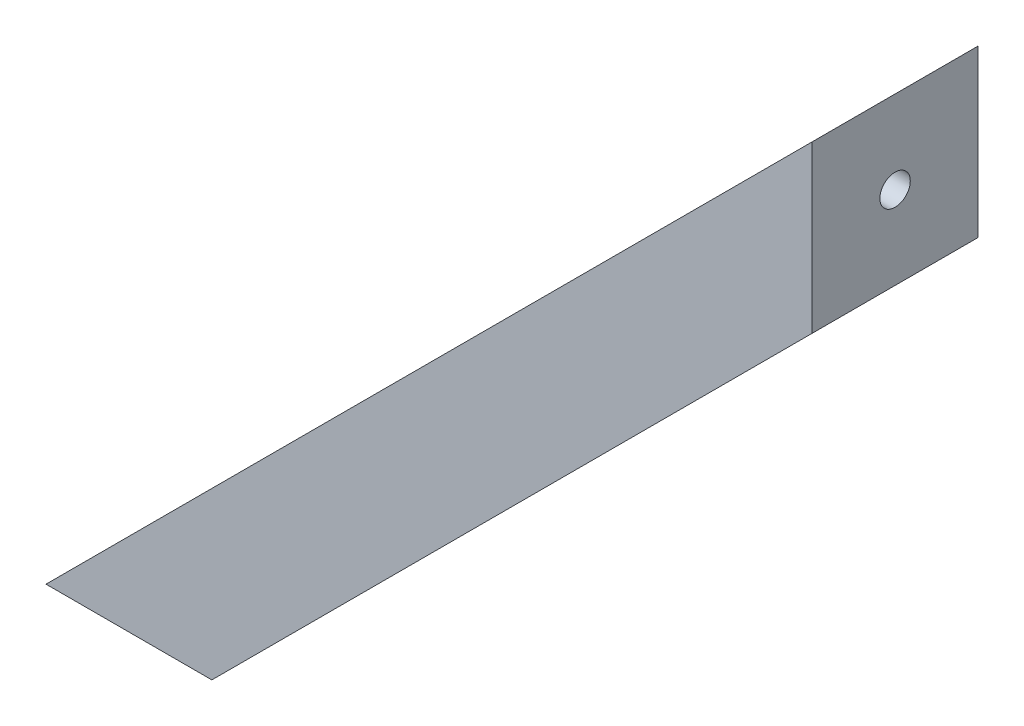
ISO-10303-21;
HEADER;
FILE_DESCRIPTION(('STEP AP214'),'2;1');
FILE_NAME('part.step','',(''),(''),'','','');
FILE_SCHEMA(('AUTOMOTIVE_DESIGN { 1 0 10303 214 1 1 1 1 }'));
ENDSEC;
DATA;
#1=APPLICATION_CONTEXT('core data for automotive mechanical design processes');
#2=APPLICATION_PROTOCOL_DEFINITION('international standard','automotive_design',2000,#1);
#3=PRODUCT_CONTEXT('',#1,'mechanical');
#4=PRODUCT('Part','Part','',(#3));
#5=PRODUCT_RELATED_PRODUCT_CATEGORY('part','',(#4));
#6=PRODUCT_DEFINITION_FORMATION('','',#4);
#7=PRODUCT_DEFINITION_CONTEXT('part definition',#1,'design');
#8=PRODUCT_DEFINITION('design','',#6,#7);
#9=PRODUCT_DEFINITION_SHAPE('','',#8);
#10=(LENGTH_UNIT() NAMED_UNIT(*) SI_UNIT(.MILLI.,.METRE.));
#11=(NAMED_UNIT(*) PLANE_ANGLE_UNIT() SI_UNIT($,.RADIAN.));
#12=(NAMED_UNIT(*) SI_UNIT($,.STERADIAN.) SOLID_ANGLE_UNIT());
#13=UNCERTAINTY_MEASURE_WITH_UNIT(LENGTH_MEASURE(1.E-05),#10,'distance_accuracy_value','');
#14=(GEOMETRIC_REPRESENTATION_CONTEXT(3) GLOBAL_UNCERTAINTY_ASSIGNED_CONTEXT((#13)) GLOBAL_UNIT_ASSIGNED_CONTEXT((#10,
#11,#12)) REPRESENTATION_CONTEXT('',''));
#15=CARTESIAN_POINT('',(0.,0.,0.));
#16=DIRECTION('',(0.,0.,1.));
#17=DIRECTION('',(1.,0.,0.));
#18=AXIS2_PLACEMENT_3D('',#15,#16,#17);
#19=CARTESIAN_POINT('',(171.52289191242,142.403148033491,38.1));
#20=DIRECTION('',(-0.707106781186546,0.707106781186549,0.));
#21=DIRECTION('',(-0.707106781186549,-0.707106781186546,0.));
#22=AXIS2_PLACEMENT_3D('',#19,#20,#21);
#23=PLANE('',#22);
#24=DIRECTION('',(0.,0.,1.));
#25=VECTOR('',#24,1.);
#26=CARTESIAN_POINT('',(68.800618910722,39.6808750317935,6.35));
#27=LINE('',#26,#25);
#28=CARTESIAN_POINT('',(68.800618910722,39.6808750317935,6.35));
#29=VERTEX_POINT('',#28);
#30=CARTESIAN_POINT('',(68.800618910722,39.6808750317935,31.75));
#31=VERTEX_POINT('',#30);
#32=EDGE_CURVE('E59',#29,#31,#27,.T.);
#33=ORIENTED_EDGE('',*,*,#32,.T.);
#34=DIRECTION('',(0.707106781186549,0.707106781186546,0.));
#35=VECTOR('',#34,1.);
#36=CARTESIAN_POINT('',(171.52289191242,142.403148033491,31.75));
#37=LINE('',#36,#35);
#38=CARTESIAN_POINT('',(100.231515334464,71.1117714555355,31.75));
#39=VERTEX_POINT('',#38);
#40=EDGE_CURVE('E290',#31,#39,#37,.T.);
#41=ORIENTED_EDGE('',*,*,#40,.T.);
#42=DIRECTION('',(0.,0.,-1.));
#43=VECTOR('',#42,1.);
#44=CARTESIAN_POINT('',(100.231515334464,71.1117714555355,6.35));
#45=LINE('',#44,#43);
#46=CARTESIAN_POINT('',(100.231515334464,71.1117714555355,6.35));
#47=VERTEX_POINT('',#46);
#48=EDGE_CURVE('E240',#39,#47,#45,.T.);
#49=ORIENTED_EDGE('',*,*,#48,.T.);
#50=DIRECTION('',(0.707106781186549,0.707106781186546,0.));
#51=VECTOR('',#50,1.);
#52=CARTESIAN_POINT('',(171.52289191242,142.403148033491,6.35));
#53=LINE('',#52,#51);
#54=EDGE_CURVE('E282',#29,#47,#53,.T.);
#55=ORIENTED_EDGE('',*,*,#54,.F.);
#56=EDGE_LOOP('',(#33,#41,#49,#55));
#57=FACE_BOUND('',#56,.T.);
#58=ADVANCED_FACE('F43',(#57),#23,.T.);
#59=CARTESIAN_POINT('',(0.,0.,31.75));
#60=DIRECTION('',(0.,0.,1.));
#61=DIRECTION('',(1.,0.,0.));
#62=AXIS2_PLACEMENT_3D('',#59,#60,#61);
#63=PLANE('',#62);
#64=ORIENTED_EDGE('',*,*,#40,.F.);
#65=DIRECTION('',(-0.707106781186551,0.707106781186544,0.));
#66=VECTOR('',#65,1.);
#67=CARTESIAN_POINT('',(87.3138911768564,21.1676027656593,31.75));
#68=LINE('',#67,#66);
#69=CARTESIAN_POINT('',(54.2407469712574,54.240746971258,31.75));
#70=VERTEX_POINT('',#69);
#71=EDGE_CURVE('E436',#31,#70,#68,.T.);
#72=ORIENTED_EDGE('',*,*,#71,.T.);
#73=DIRECTION('',(-0.707106781186544,-0.707106781186552,0.));
#74=VECTOR('',#73,1.);
#75=CARTESIAN_POINT('',(0.,0.,31.75));
#76=LINE('',#75,#74);
#77=CARTESIAN_POINT('',(85.6716433949993,85.6716433950002,31.75));
#78=VERTEX_POINT('',#77);
#79=EDGE_CURVE('E301',#78,#70,#76,.T.);
#80=ORIENTED_EDGE('',*,*,#79,.F.);
#81=DIRECTION('',(-0.707106781186551,0.707106781186544,0.));
#82=VECTOR('',#81,1.);
#83=CARTESIAN_POINT('',(118.744787600598,52.5984991894015,31.75));
#84=LINE('',#83,#82);
#85=EDGE_CURVE('E253',#39,#78,#84,.T.);
#86=ORIENTED_EDGE('',*,*,#85,.F.);
#87=EDGE_LOOP('',(#64,#72,#80,#86));
#88=FACE_BOUND('',#87,.T.);
#89=ADVANCED_FACE('F359',(#88),#63,.F.);
#90=CARTESIAN_POINT('',(0.,0.,6.35));
#91=DIRECTION('',(0.,0.,1.));
#92=DIRECTION('',(1.,0.,0.));
#93=AXIS2_PLACEMENT_3D('',#90,#91,#92);
#94=PLANE('',#93);
#95=DIRECTION('',(-0.707106781186551,0.707106781186544,0.));
#96=VECTOR('',#95,1.);
#97=CARTESIAN_POINT('',(87.3138911768564,21.1676027656593,6.35));
#98=LINE('',#97,#96);
#99=CARTESIAN_POINT('',(54.2407469712574,54.240746971258,6.35));
#100=VERTEX_POINT('',#99);
#101=EDGE_CURVE('E216',#29,#100,#98,.T.);
#102=ORIENTED_EDGE('',*,*,#101,.F.);
#103=ORIENTED_EDGE('',*,*,#54,.T.);
#104=DIRECTION('',(-0.707106781186551,0.707106781186544,0.));
#105=VECTOR('',#104,1.);
#106=CARTESIAN_POINT('',(118.744787600598,52.5984991894015,6.35));
#107=LINE('',#106,#105);
#108=CARTESIAN_POINT('',(85.6716433949993,85.6716433950002,6.35));
#109=VERTEX_POINT('',#108);
#110=EDGE_CURVE('E247',#47,#109,#107,.T.);
#111=ORIENTED_EDGE('',*,*,#110,.T.);
#112=DIRECTION('',(-0.707106781186544,-0.707106781186552,0.));
#113=VECTOR('',#112,1.);
#114=CARTESIAN_POINT('',(0.,0.,6.35));
#115=LINE('',#114,#113);
#116=EDGE_CURVE('E192',#109,#100,#115,.T.);
#117=ORIENTED_EDGE('',*,*,#116,.T.);
#118=EDGE_LOOP('',(#102,#103,#111,#117));
#119=FACE_BOUND('',#118,.T.);
#120=ADVANCED_FACE('F367',(#119),#94,.T.);
#121=DIRECTION('',(0.,0.,1.));
#122=VECTOR('',#121,1.);
#123=CARTESIAN_POINT('',(140.642667879275,111.522924000347,6.35));
#124=LINE('',#123,#122);
#125=CARTESIAN_POINT('',(140.642667879275,111.522924000347,6.35));
#126=VERTEX_POINT('',#125);
#127=CARTESIAN_POINT('',(140.642667879275,111.522924000347,31.75));
#128=VERTEX_POINT('',#127);
#129=EDGE_CURVE('E210',#126,#128,#124,.T.);
#130=ORIENTED_EDGE('',*,*,#129,.T.);
#131=CARTESIAN_POINT('',(169.663019972954,140.543276094026,31.75));
#132=VERTEX_POINT('',#131);
#133=EDGE_CURVE('E280',#128,#132,#37,.T.);
#134=ORIENTED_EDGE('',*,*,#133,.T.);
#135=DIRECTION('',(0.,0.,-1.));
#136=VECTOR('',#135,1.);
#137=CARTESIAN_POINT('',(169.663019972954,140.543276094026,38.1));
#138=LINE('',#137,#136);
#139=CARTESIAN_POINT('',(169.663019972954,140.543276094026,6.35));
#140=VERTEX_POINT('',#139);
#141=EDGE_CURVE('E276',#132,#140,#138,.T.);
#142=ORIENTED_EDGE('',*,*,#141,.T.);
#143=EDGE_CURVE('E271',#126,#140,#53,.T.);
#144=ORIENTED_EDGE('',*,*,#143,.F.);
#145=EDGE_LOOP('',(#130,#134,#142,#144));
#146=FACE_BOUND('',#145,.T.);
#147=ADVANCED_FACE('F361',(#146),#23,.T.);
#148=ORIENTED_EDGE('',*,*,#133,.F.);
#149=DIRECTION('',(-0.707106781186551,0.707106781186544,0.));
#150=VECTOR('',#149,1.);
#151=CARTESIAN_POINT('',(159.155940145409,93.0096517342129,31.75));
#152=LINE('',#151,#150);
#153=CARTESIAN_POINT('',(126.08279593981,126.082795939812,31.75));
#154=VERTEX_POINT('',#153);
#155=EDGE_CURVE('E226',#128,#154,#152,.T.);
#156=ORIENTED_EDGE('',*,*,#155,.T.);
#157=CARTESIAN_POINT('',(169.663019972954,169.663019972956,31.75));
#158=VERTEX_POINT('',#157);
#159=EDGE_CURVE('E297',#158,#154,#76,.T.);
#160=ORIENTED_EDGE('',*,*,#159,.F.);
#161=DIRECTION('',(0.,1.,0.));
#162=VECTOR('',#161,1.);
#163=CARTESIAN_POINT('',(169.663019972954,176.013019972956,31.75));
#164=LINE('',#163,#162);
#165=EDGE_CURVE('E289',#132,#158,#164,.T.);
#166=ORIENTED_EDGE('',*,*,#165,.F.);
#167=EDGE_LOOP('',(#148,#156,#160,#166));
#168=FACE_BOUND('',#167,.T.);
#169=ADVANCED_FACE('F370',(#168),#63,.F.);
#170=DIRECTION('',(-0.707106781186551,0.707106781186544,0.));
#171=VECTOR('',#170,1.);
#172=CARTESIAN_POINT('',(159.155940145409,93.0096517342129,6.35));
#173=LINE('',#172,#171);
#174=CARTESIAN_POINT('',(126.08279593981,126.082795939812,6.35));
#175=VERTEX_POINT('',#174);
#176=EDGE_CURVE('E229',#126,#175,#173,.T.);
#177=ORIENTED_EDGE('',*,*,#176,.F.);
#178=ORIENTED_EDGE('',*,*,#143,.T.);
#179=DIRECTION('',(0.,1.,0.));
#180=VECTOR('',#179,1.);
#181=CARTESIAN_POINT('',(169.663019972954,176.013019972956,6.35));
#182=LINE('',#181,#180);
#183=CARTESIAN_POINT('',(169.663019972954,169.663019972956,6.35));
#184=VERTEX_POINT('',#183);
#185=EDGE_CURVE('E193',#140,#184,#182,.T.);
#186=ORIENTED_EDGE('',*,*,#185,.T.);
#187=EDGE_CURVE('E196',#184,#175,#115,.T.);
#188=ORIENTED_EDGE('',*,*,#187,.T.);
#189=EDGE_LOOP('',(#177,#178,#186,#188));
#190=FACE_BOUND('',#189,.T.);
#191=ADVANCED_FACE('F391',(#190),#94,.T.);
#192=DIRECTION('',(0.,0.,-1.));
#193=VECTOR('',#192,1.);
#194=CARTESIAN_POINT('',(136.152539818741,107.032795939812,6.35));
#195=LINE('',#194,#193);
#196=CARTESIAN_POINT('',(136.152539818741,107.032795939812,31.75));
#197=VERTEX_POINT('',#196);
#198=CARTESIAN_POINT('',(136.152539818741,107.032795939812,6.35));
#199=VERTEX_POINT('',#198);
#200=EDGE_CURVE('E207',#197,#199,#195,.T.);
#201=ORIENTED_EDGE('',*,*,#200,.T.);
#202=CARTESIAN_POINT('',(104.721643394999,75.60189951607,6.35));
#203=VERTEX_POINT('',#202);
#204=EDGE_CURVE('E283',#203,#199,#53,.T.);
#205=ORIENTED_EDGE('',*,*,#204,.F.);
#206=DIRECTION('',(0.,0.,1.));
#207=VECTOR('',#206,1.);
#208=CARTESIAN_POINT('',(104.721643394999,75.60189951607,6.35));
#209=LINE('',#208,#207);
#210=CARTESIAN_POINT('',(104.721643394999,75.60189951607,31.75));
#211=VERTEX_POINT('',#210);
#212=EDGE_CURVE('E238',#203,#211,#209,.T.);
#213=ORIENTED_EDGE('',*,*,#212,.T.);
#214=EDGE_CURVE('E291',#211,#197,#37,.T.);
#215=ORIENTED_EDGE('',*,*,#214,.T.);
#216=EDGE_LOOP('',(#201,#205,#213,#215));
#217=FACE_BOUND('',#216,.T.);
#218=ADVANCED_FACE('F376',(#217),#23,.T.);
#219=CARTESIAN_POINT('',(121.592667879276,121.592667879277,31.75));
#220=VERTEX_POINT('',#219);
#221=CARTESIAN_POINT('',(90.1617714555338,90.1617714555348,31.75));
#222=VERTEX_POINT('',#221);
#223=EDGE_CURVE('E300',#220,#222,#76,.T.);
#224=ORIENTED_EDGE('',*,*,#223,.F.);
#225=DIRECTION('',(-0.707106781186551,0.707106781186544,0.));
#226=VECTOR('',#225,1.);
#227=CARTESIAN_POINT('',(154.665812084875,88.5195236736783,31.75));
#228=LINE('',#227,#226);
#229=EDGE_CURVE('E223',#197,#220,#228,.T.);
#230=ORIENTED_EDGE('',*,*,#229,.F.);
#231=ORIENTED_EDGE('',*,*,#214,.F.);
#232=DIRECTION('',(-0.707106781186551,0.707106781186544,0.));
#233=VECTOR('',#232,1.);
#234=CARTESIAN_POINT('',(123.234915661133,57.0886272499361,31.75));
#235=LINE('',#234,#233);
#236=EDGE_CURVE('E250',#211,#222,#235,.T.);
#237=ORIENTED_EDGE('',*,*,#236,.T.);
#238=EDGE_LOOP('',(#224,#230,#231,#237));
#239=FACE_BOUND('',#238,.T.);
#240=ADVANCED_FACE('F390',(#239),#63,.F.);
#241=DIRECTION('',(-0.707106781186551,0.707106781186544,0.));
#242=VECTOR('',#241,1.);
#243=CARTESIAN_POINT('',(154.665812084875,88.5195236736783,6.35));
#244=LINE('',#243,#242);
#245=CARTESIAN_POINT('',(121.592667879276,121.592667879277,6.35));
#246=VERTEX_POINT('',#245);
#247=EDGE_CURVE('E219',#199,#246,#244,.T.);
#248=ORIENTED_EDGE('',*,*,#247,.T.);
#249=CARTESIAN_POINT('',(90.1617714555338,90.1617714555348,6.35));
#250=VERTEX_POINT('',#249);
#251=EDGE_CURVE('E195',#246,#250,#115,.T.);
#252=ORIENTED_EDGE('',*,*,#251,.T.);
#253=DIRECTION('',(-0.707106781186551,0.707106781186544,0.));
#254=VECTOR('',#253,1.);
#255=CARTESIAN_POINT('',(123.234915661133,57.0886272499361,6.35));
#256=LINE('',#255,#254);
#257=EDGE_CURVE('E241',#203,#250,#256,.T.);
#258=ORIENTED_EDGE('',*,*,#257,.F.);
#259=ORIENTED_EDGE('',*,*,#204,.T.);
#260=EDGE_LOOP('',(#248,#252,#258,#259));
#261=FACE_BOUND('',#260,.T.);
#262=ADVANCED_FACE('F397',(#261),#94,.T.);
#263=CARTESIAN_POINT('',(0.,0.,38.1));
#264=DIRECTION('',(0.707106781186552,-0.707106781186544,0.));
#265=DIRECTION('',(0.707106781186544,0.707106781186552,0.));
#266=AXIS2_PLACEMENT_3D('',#263,#264,#265);
#267=PLANE('',#266);
#268=ORIENTED_EDGE('',*,*,#79,.T.);
#269=DIRECTION('',(0.,0.,-1.));
#270=VECTOR('',#269,1.);
#271=CARTESIAN_POINT('',(54.2407469712574,54.240746971258,6.35));
#272=LINE('',#271,#270);
#273=EDGE_CURVE('E204',#70,#100,#272,.T.);
#274=ORIENTED_EDGE('',*,*,#273,.T.);
#275=ORIENTED_EDGE('',*,*,#116,.F.);
#276=DIRECTION('',(0.,0.,1.));
#277=VECTOR('',#276,1.);
#278=CARTESIAN_POINT('',(85.6716433949993,85.6716433950002,6.35));
#279=LINE('',#278,#277);
#280=EDGE_CURVE('E235',#109,#78,#279,.T.);
#281=ORIENTED_EDGE('',*,*,#280,.T.);
#282=EDGE_LOOP('',(#268,#274,#275,#281));
#283=FACE_BOUND('',#282,.T.);
#284=ORIENTED_EDGE('',*,*,#251,.F.);
#285=DIRECTION('',(0.,0.,1.));
#286=VECTOR('',#285,1.);
#287=CARTESIAN_POINT('',(121.592667879276,121.592667879277,6.35));
#288=LINE('',#287,#286);
#289=EDGE_CURVE('E233',#246,#220,#288,.T.);
#290=ORIENTED_EDGE('',*,*,#289,.T.);
#291=ORIENTED_EDGE('',*,*,#223,.T.);
#292=DIRECTION('',(0.,0.,-1.));
#293=VECTOR('',#292,1.);
#294=CARTESIAN_POINT('',(90.1617714555338,90.1617714555348,6.35));
#295=LINE('',#294,#293);
#296=EDGE_CURVE('E244',#222,#250,#295,.T.);
#297=ORIENTED_EDGE('',*,*,#296,.T.);
#298=EDGE_LOOP('',(#284,#290,#291,#297));
#299=FACE_BOUND('',#298,.T.);
#300=ORIENTED_EDGE('',*,*,#159,.T.);
#301=DIRECTION('',(0.,0.,-1.));
#302=VECTOR('',#301,1.);
#303=CARTESIAN_POINT('',(126.08279593981,126.082795939812,6.35));
#304=LINE('',#303,#302);
#305=EDGE_CURVE('E222',#154,#175,#304,.T.);
#306=ORIENTED_EDGE('',*,*,#305,.T.);
#307=ORIENTED_EDGE('',*,*,#187,.F.);
#308=DIRECTION('',(0.,0.,-1.));
#309=VECTOR('',#308,1.);
#310=CARTESIAN_POINT('',(169.663019972954,169.663019972956,38.1));
#311=LINE('',#310,#309);
#312=EDGE_CURVE('E286',#158,#184,#311,.T.);
#313=ORIENTED_EDGE('',*,*,#312,.F.);
#314=EDGE_LOOP('',(#300,#306,#307,#313));
#315=FACE_BOUND('',#314,.T.);
#316=DIRECTION('',(-0.707106781186544,-0.707106781186552,0.));
#317=VECTOR('',#316,1.);
#318=CARTESIAN_POINT('',(0.,0.,0.));
#319=LINE('',#318,#317);
#320=CARTESIAN_POINT('',(176.013019972954,176.013019972956,0.));
#321=VERTEX_POINT('',#320);
#322=CARTESIAN_POINT('',(0.,0.,0.));
#323=VERTEX_POINT('',#322);
#324=EDGE_CURVE('E309',#321,#323,#319,.T.);
#325=ORIENTED_EDGE('',*,*,#324,.T.);
#326=DIRECTION('',(0.,0.,-1.));
#327=VECTOR('',#326,1.);
#328=CARTESIAN_POINT('',(0.,0.,38.1));
#329=LINE('',#328,#327);
#330=CARTESIAN_POINT('',(0.,0.,38.1));
#331=VERTEX_POINT('',#330);
#332=EDGE_CURVE('E315',#331,#323,#329,.T.);
#333=ORIENTED_EDGE('',*,*,#332,.F.);
#334=DIRECTION('',(-0.707106781186544,-0.707106781186552,0.));
#335=VECTOR('',#334,1.);
#336=CARTESIAN_POINT('',(0.,0.,38.1));
#337=LINE('',#336,#335);
#338=CARTESIAN_POINT('',(176.013019972954,176.013019972956,38.1));
#339=VERTEX_POINT('',#338);
#340=EDGE_CURVE('E313',#339,#331,#337,.T.);
#341=ORIENTED_EDGE('',*,*,#340,.F.);
#342=DIRECTION('',(0.,0.,-1.));
#343=VECTOR('',#342,1.);
#344=CARTESIAN_POINT('',(176.013019972954,176.013019972956,38.1));
#345=LINE('',#344,#343);
#346=EDGE_CURVE('E325',#339,#321,#345,.T.);
#347=ORIENTED_EDGE('',*,*,#346,.T.);
#348=EDGE_LOOP('',(#325,#333,#341,#347));
#349=FACE_BOUND('',#348,.T.);
#350=DIRECTION('',(0.,0.,1.));
#351=VECTOR('',#350,1.);
#352=CARTESIAN_POINT('',(49.7506189107229,49.7506189107234,6.35));
#353=LINE('',#352,#351);
#354=CARTESIAN_POINT('',(49.7506189107229,49.7506189107234,6.35));
#355=VERTEX_POINT('',#354);
#356=CARTESIAN_POINT('',(49.7506189107228,49.7506189107234,31.75));
#357=VERTEX_POINT('',#356);
#358=EDGE_CURVE('E186',#355,#357,#353,.T.);
#359=ORIENTED_EDGE('',*,*,#358,.T.);
#360=CARTESIAN_POINT('',(6.35000000000034,6.35000000000041,31.75));
#361=VERTEX_POINT('',#360);
#362=EDGE_CURVE('E295',#357,#361,#76,.T.);
#363=ORIENTED_EDGE('',*,*,#362,.T.);
#364=DIRECTION('',(0.,0.,-1.));
#365=VECTOR('',#364,1.);
#366=CARTESIAN_POINT('',(6.35000000000034,6.35000000000041,38.1));
#367=LINE('',#366,#365);
#368=CARTESIAN_POINT('',(6.35000000000034,6.35000000000041,6.35));
#369=VERTEX_POINT('',#368);
#370=EDGE_CURVE('E188',#361,#369,#367,.T.);
#371=ORIENTED_EDGE('',*,*,#370,.T.);
#372=EDGE_CURVE('E182',#355,#369,#115,.T.);
#373=ORIENTED_EDGE('',*,*,#372,.F.);
#374=EDGE_LOOP('',(#359,#363,#371,#373));
#375=FACE_BOUND('',#374,.T.);
#376=ADVANCED_FACE('F184',(#283,#299,#315,#349,#375),#267,.F.);
#377=CARTESIAN_POINT('',(38.1,2.48888480237083E-12,38.1));
#378=DIRECTION('',(0.,1.,0.));
#379=DIRECTION('',(-1.,0.,0.));
#380=AXIS2_PLACEMENT_3D('',#377,#378,#379);
#381=PLANE('',#380);
#382=CARTESIAN_POINT('',(19.05,1.24444240118542E-12,19.05));
#383=DIRECTION('',(0.,-1.,0.));
#384=DIRECTION('',(1.,0.,0.));
#385=AXIS2_PLACEMENT_3D('',#382,#383,#384);
#386=CIRCLE('',#385,3.4925);
#387=CARTESIAN_POINT('',(22.5425,1.47259017473608E-12,19.05));
#388=VERTEX_POINT('',#387);
#389=EDGE_CURVE('E263',#388,#388,#386,.T.);
#390=ORIENTED_EDGE('',*,*,#389,.F.);
#391=EDGE_LOOP('',(#390));
#392=FACE_BOUND('',#391,.T.);
#393=DIRECTION('',(1.,0.,0.));
#394=VECTOR('',#393,1.);
#395=CARTESIAN_POINT('',(38.1,2.48888480237083E-12,0.));
#396=LINE('',#395,#394);
#397=CARTESIAN_POINT('',(38.1,2.48888480237083E-12,0.));
#398=VERTEX_POINT('',#397);
#399=EDGE_CURVE('E275',#323,#398,#396,.T.);
#400=ORIENTED_EDGE('',*,*,#399,.T.);
#401=DIRECTION('',(0.,0.,-1.));
#402=VECTOR('',#401,1.);
#403=CARTESIAN_POINT('',(38.1,2.48888480237083E-12,38.1));
#404=LINE('',#403,#402);
#405=CARTESIAN_POINT('',(38.1,2.48888480237083E-12,38.1));
#406=VERTEX_POINT('',#405);
#407=EDGE_CURVE('E11',#406,#398,#404,.T.);
#408=ORIENTED_EDGE('',*,*,#407,.F.);
#409=DIRECTION('',(1.,0.,0.));
#410=VECTOR('',#409,1.);
#411=CARTESIAN_POINT('',(38.1,2.48888480237083E-12,38.1));
#412=LINE('',#411,#410);
#413=EDGE_CURVE('E305',#331,#406,#412,.T.);
#414=ORIENTED_EDGE('',*,*,#413,.F.);
#415=ORIENTED_EDGE('',*,*,#332,.T.);
#416=EDGE_LOOP('',(#400,#408,#414,#415));
#417=FACE_BOUND('',#416,.T.);
#418=ADVANCED_FACE('F45',(#392,#417),#381,.F.);
#419=CARTESIAN_POINT('',(176.013019972954,137.913019972956,38.1));
#420=DIRECTION('',(-0.707106781186546,0.707106781186549,0.));
#421=DIRECTION('',(-0.707106781186549,-0.707106781186546,0.));
#422=AXIS2_PLACEMENT_3D('',#419,#420,#421);
#423=PLANE('',#422);
#424=DIRECTION('',(0.707106781186549,0.707106781186546,0.));
#425=VECTOR('',#424,1.);
#426=CARTESIAN_POINT('',(176.013019972954,137.913019972956,0.));
#427=LINE('',#426,#425);
#428=CARTESIAN_POINT('',(176.013019972954,137.913019972956,0.));
#429=VERTEX_POINT('',#428);
#430=EDGE_CURVE('E318',#398,#429,#427,.T.);
#431=ORIENTED_EDGE('',*,*,#430,.T.);
#432=DIRECTION('',(0.,0.,-1.));
#433=VECTOR('',#432,1.);
#434=CARTESIAN_POINT('',(176.013019972954,137.913019972956,38.1));
#435=LINE('',#434,#433);
#436=CARTESIAN_POINT('',(176.013019972954,137.913019972956,38.1));
#437=VERTEX_POINT('',#436);
#438=EDGE_CURVE('E52',#437,#429,#435,.T.);
#439=ORIENTED_EDGE('',*,*,#438,.F.);
#440=DIRECTION('',(0.707106781186549,0.707106781186546,0.));
#441=VECTOR('',#440,1.);
#442=CARTESIAN_POINT('',(176.013019972954,137.913019972956,38.1));
#443=LINE('',#442,#441);
#444=EDGE_CURVE('E308',#406,#437,#443,.T.);
#445=ORIENTED_EDGE('',*,*,#444,.F.);
#446=ORIENTED_EDGE('',*,*,#407,.T.);
#447=EDGE_LOOP('',(#431,#439,#445,#446));
#448=FACE_BOUND('',#447,.T.);
#449=ADVANCED_FACE('F348',(#448),#423,.F.);
#450=CARTESIAN_POINT('',(176.013019972954,176.013019972956,38.1));
#451=DIRECTION('',(-1.,0.,0.));
#452=DIRECTION('',(0.,0.,1.));
#453=AXIS2_PLACEMENT_3D('',#450,#451,#452);
#454=PLANE('',#453);
#455=CARTESIAN_POINT('',(176.013019972954,156.963019972956,19.05));
#456=DIRECTION('',(1.,0.,0.));
#457=DIRECTION('',(0.,0.,-1.));
#458=AXIS2_PLACEMENT_3D('',#455,#456,#457);
#459=CIRCLE('',#458,3.4925);
#460=CARTESIAN_POINT('',(176.013019972954,156.963019972956,15.5575));
#461=VERTEX_POINT('',#460);
#462=EDGE_CURVE('E260',#461,#461,#459,.T.);
#463=ORIENTED_EDGE('',*,*,#462,.F.);
#464=EDGE_LOOP('',(#463));
#465=FACE_BOUND('',#464,.T.);
#466=DIRECTION('',(0.,1.,0.));
#467=VECTOR('',#466,1.);
#468=CARTESIAN_POINT('',(176.013019972954,176.013019972956,0.));
#469=LINE('',#468,#467);
#470=EDGE_CURVE('E320',#429,#321,#469,.T.);
#471=ORIENTED_EDGE('',*,*,#470,.T.);
#472=ORIENTED_EDGE('',*,*,#346,.F.);
#473=DIRECTION('',(0.,1.,0.));
#474=VECTOR('',#473,1.);
#475=CARTESIAN_POINT('',(176.013019972954,176.013019972956,38.1));
#476=LINE('',#475,#474);
#477=EDGE_CURVE('E311',#437,#339,#476,.T.);
#478=ORIENTED_EDGE('',*,*,#477,.F.);
#479=ORIENTED_EDGE('',*,*,#438,.T.);
#480=EDGE_LOOP('',(#471,#472,#478,#479));
#481=FACE_BOUND('',#480,.T.);
#482=ADVANCED_FACE('F333',(#465,#481),#454,.F.);
#483=CARTESIAN_POINT('',(0.,0.,38.1));
#484=DIRECTION('',(0.,0.,1.));
#485=DIRECTION('',(1.,0.,0.));
#486=AXIS2_PLACEMENT_3D('',#483,#484,#485);
#487=PLANE('',#486);
#488=ORIENTED_EDGE('',*,*,#413,.T.);
#489=ORIENTED_EDGE('',*,*,#444,.T.);
#490=ORIENTED_EDGE('',*,*,#477,.T.);
#491=ORIENTED_EDGE('',*,*,#340,.T.);
#492=EDGE_LOOP('',(#488,#489,#490,#491));
#493=FACE_BOUND('',#492,.T.);
#494=ADVANCED_FACE('F347',(#493),#487,.T.);
#495=CARTESIAN_POINT('',(0.,0.,0.));
#496=DIRECTION('',(0.,0.,1.));
#497=DIRECTION('',(1.,0.,0.));
#498=AXIS2_PLACEMENT_3D('',#495,#496,#497);
#499=PLANE('',#498);
#500=ORIENTED_EDGE('',*,*,#399,.F.);
#501=ORIENTED_EDGE('',*,*,#324,.F.);
#502=ORIENTED_EDGE('',*,*,#470,.F.);
#503=ORIENTED_EDGE('',*,*,#430,.F.);
#504=EDGE_LOOP('',(#500,#501,#502,#503));
#505=FACE_BOUND('',#504,.T.);
#506=ADVANCED_FACE('F339',(#505),#499,.F.);
#507=CARTESIAN_POINT('',(38.0999999999996,6.35000000000249,38.1));
#508=DIRECTION('',(0.,1.,0.));
#509=DIRECTION('',(-1.,0.,0.));
#510=AXIS2_PLACEMENT_3D('',#507,#508,#509);
#511=PLANE('',#510);
#512=CARTESIAN_POINT('',(19.0499999999996,6.35000000000124,19.05));
#513=DIRECTION('',(0.,1.,0.));
#514=DIRECTION('',(-1.,0.,0.));
#515=AXIS2_PLACEMENT_3D('',#512,#513,#514);
#516=CIRCLE('',#515,3.4925);
#517=CARTESIAN_POINT('',(15.5574999999996,6.35000000000102,19.05));
#518=VERTEX_POINT('',#517);
#519=EDGE_CURVE('E266',#518,#518,#516,.F.);
#520=ORIENTED_EDGE('',*,*,#519,.T.);
#521=EDGE_LOOP('',(#520));
#522=FACE_BOUND('',#521,.T.);
#523=DIRECTION('',(1.,0.,0.));
#524=VECTOR('',#523,1.);
#525=CARTESIAN_POINT('',(38.0999999999996,6.35000000000249,6.35));
#526=LINE('',#525,#524);
#527=CARTESIAN_POINT('',(35.4697438789307,6.35000000000232,6.35));
#528=VERTEX_POINT('',#527);
#529=EDGE_CURVE('E269',#369,#528,#526,.T.);
#530=ORIENTED_EDGE('',*,*,#529,.F.);
#531=ORIENTED_EDGE('',*,*,#370,.F.);
#532=DIRECTION('',(1.,0.,0.));
#533=VECTOR('',#532,1.);
#534=CARTESIAN_POINT('',(38.0999999999996,6.35000000000249,31.75));
#535=LINE('',#534,#533);
#536=CARTESIAN_POINT('',(35.4697438789307,6.35000000000232,31.75));
#537=VERTEX_POINT('',#536);
#538=EDGE_CURVE('E277',#361,#537,#535,.T.);
#539=ORIENTED_EDGE('',*,*,#538,.T.);
#540=DIRECTION('',(0.,0.,-1.));
#541=VECTOR('',#540,1.);
#542=CARTESIAN_POINT('',(35.4697438789307,6.35000000000233,38.1));
#543=LINE('',#542,#541);
#544=EDGE_CURVE('E272',#537,#528,#543,.T.);
#545=ORIENTED_EDGE('',*,*,#544,.T.);
#546=EDGE_LOOP('',(#530,#531,#539,#545));
#547=FACE_BOUND('',#546,.T.);
#548=ADVANCED_FACE('F379',(#522,#547),#511,.T.);
#549=DIRECTION('',(0.,0.,-1.));
#550=VECTOR('',#549,1.);
#551=CARTESIAN_POINT('',(64.3104908501874,35.190746971259,6.35));
#552=LINE('',#551,#550);
#553=CARTESIAN_POINT('',(64.3104908501874,35.190746971259,31.75));
#554=VERTEX_POINT('',#553);
#555=CARTESIAN_POINT('',(64.3104908501874,35.190746971259,6.35));
#556=VERTEX_POINT('',#555);
#557=EDGE_CURVE('E217',#554,#556,#552,.T.);
#558=ORIENTED_EDGE('',*,*,#557,.T.);
#559=EDGE_CURVE('E201',#528,#556,#53,.T.);
#560=ORIENTED_EDGE('',*,*,#559,.F.);
#561=ORIENTED_EDGE('',*,*,#544,.F.);
#562=EDGE_CURVE('E287',#537,#554,#37,.T.);
#563=ORIENTED_EDGE('',*,*,#562,.T.);
#564=EDGE_LOOP('',(#558,#560,#561,#563));
#565=FACE_BOUND('',#564,.T.);
#566=ADVANCED_FACE('F362',(#565),#23,.T.);
#567=CARTESIAN_POINT('',(169.663019972954,176.013019972956,38.1));
#568=DIRECTION('',(-1.,0.,0.));
#569=DIRECTION('',(0.,0.,1.));
#570=AXIS2_PLACEMENT_3D('',#567,#568,#569);
#571=PLANE('',#570);
#572=CARTESIAN_POINT('',(169.663019972954,156.963019972956,19.05));
#573=DIRECTION('',(-1.,0.,0.));
#574=DIRECTION('',(0.,0.,1.));
#575=AXIS2_PLACEMENT_3D('',#572,#573,#574);
#576=CIRCLE('',#575,3.4925);
#577=CARTESIAN_POINT('',(169.663019972954,156.963019972956,22.5425));
#578=VERTEX_POINT('',#577);
#579=EDGE_CURVE('E47',#578,#578,#576,.T.);
#580=ORIENTED_EDGE('',*,*,#579,.F.);
#581=EDGE_LOOP('',(#580));
#582=FACE_BOUND('',#581,.T.);
#583=ORIENTED_EDGE('',*,*,#185,.F.);
#584=ORIENTED_EDGE('',*,*,#141,.F.);
#585=ORIENTED_EDGE('',*,*,#165,.T.);
#586=ORIENTED_EDGE('',*,*,#312,.T.);
#587=EDGE_LOOP('',(#583,#584,#585,#586));
#588=FACE_BOUND('',#587,.T.);
#589=ADVANCED_FACE('F378',(#582,#588),#571,.T.);
#590=ORIENTED_EDGE('',*,*,#362,.F.);
#591=DIRECTION('',(-0.707106781186551,0.707106781186544,0.));
#592=VECTOR('',#591,1.);
#593=CARTESIAN_POINT('',(82.8237631163219,16.6774747051247,31.75));
#594=LINE('',#593,#592);
#595=EDGE_CURVE('E67',#554,#357,#594,.T.);
#596=ORIENTED_EDGE('',*,*,#595,.F.);
#597=ORIENTED_EDGE('',*,*,#562,.F.);
#598=ORIENTED_EDGE('',*,*,#538,.F.);
#599=EDGE_LOOP('',(#590,#596,#597,#598));
#600=FACE_BOUND('',#599,.T.);
#601=ADVANCED_FACE('F371',(#600),#63,.F.);
#602=DIRECTION('',(-0.707106781186551,0.707106781186544,0.));
#603=VECTOR('',#602,1.);
#604=CARTESIAN_POINT('',(82.8237631163219,16.6774747051247,6.35));
#605=LINE('',#604,#603);
#606=EDGE_CURVE('E199',#556,#355,#605,.T.);
#607=ORIENTED_EDGE('',*,*,#606,.T.);
#608=ORIENTED_EDGE('',*,*,#372,.T.);
#609=ORIENTED_EDGE('',*,*,#529,.T.);
#610=ORIENTED_EDGE('',*,*,#559,.T.);
#611=EDGE_LOOP('',(#607,#608,#609,#610));
#612=FACE_BOUND('',#611,.T.);
#613=ADVANCED_FACE('F200',(#612),#94,.T.);
#614=CARTESIAN_POINT('',(19.0499999999989,16.2282817331771,19.05));
#615=DIRECTION('',(0.,-1.,0.));
#616=DIRECTION('',(1.,0.,0.));
#617=AXIS2_PLACEMENT_3D('',#614,#615,#616);
#618=CYLINDRICAL_SURFACE('',#617,3.4925);
#619=ORIENTED_EDGE('',*,*,#389,.T.);
#620=EDGE_LOOP('',(#619));
#621=FACE_BOUND('',#620,.T.);
#622=ORIENTED_EDGE('',*,*,#519,.F.);
#623=EDGE_LOOP('',(#622));
#624=FACE_BOUND('',#623,.T.);
#625=ADVANCED_FACE('F457',(#621,#624),#618,.F.);
#626=CARTESIAN_POINT('',(116.577019972954,156.963019972956,19.05));
#627=DIRECTION('',(1.,0.,0.));
#628=DIRECTION('',(0.,0.,-1.));
#629=AXIS2_PLACEMENT_3D('',#626,#627,#628);
#630=CYLINDRICAL_SURFACE('',#629,3.4925);
#631=ORIENTED_EDGE('',*,*,#579,.T.);
#632=EDGE_LOOP('',(#631));
#633=FACE_BOUND('',#632,.T.);
#634=ORIENTED_EDGE('',*,*,#462,.T.);
#635=EDGE_LOOP('',(#634));
#636=FACE_BOUND('',#635,.T.);
#637=ADVANCED_FACE('F450',(#633,#636),#630,.F.);
#638=CARTESIAN_POINT('',(123.234915661133,57.0886272499361,6.35));
#639=DIRECTION('',(0.707106781186544,0.707106781186551,0.));
#640=DIRECTION('',(-0.707106781186551,0.707106781186544,0.));
#641=AXIS2_PLACEMENT_3D('',#638,#639,#640);
#642=PLANE('',#641);
#643=ORIENTED_EDGE('',*,*,#212,.F.);
#644=ORIENTED_EDGE('',*,*,#257,.T.);
#645=ORIENTED_EDGE('',*,*,#296,.F.);
#646=ORIENTED_EDGE('',*,*,#236,.F.);
#647=EDGE_LOOP('',(#643,#644,#645,#646));
#648=FACE_BOUND('',#647,.T.);
#649=ADVANCED_FACE('F448',(#648),#642,.T.);
#650=CARTESIAN_POINT('',(118.744787600598,52.5984991894015,6.35));
#651=DIRECTION('',(-0.707106781186544,-0.707106781186551,0.));
#652=DIRECTION('',(0.707106781186551,-0.707106781186544,0.));
#653=AXIS2_PLACEMENT_3D('',#650,#651,#652);
#654=PLANE('',#653);
#655=ORIENTED_EDGE('',*,*,#48,.F.);
#656=ORIENTED_EDGE('',*,*,#85,.T.);
#657=ORIENTED_EDGE('',*,*,#280,.F.);
#658=ORIENTED_EDGE('',*,*,#110,.F.);
#659=EDGE_LOOP('',(#655,#656,#657,#658));
#660=FACE_BOUND('',#659,.T.);
#661=ADVANCED_FACE('F430',(#660),#654,.T.);
#662=CARTESIAN_POINT('',(159.155940145409,93.0096517342129,6.35));
#663=DIRECTION('',(0.707106781186544,0.707106781186551,0.));
#664=DIRECTION('',(-0.707106781186551,0.707106781186544,0.));
#665=AXIS2_PLACEMENT_3D('',#662,#663,#664);
#666=PLANE('',#665);
#667=ORIENTED_EDGE('',*,*,#129,.F.);
#668=ORIENTED_EDGE('',*,*,#176,.T.);
#669=ORIENTED_EDGE('',*,*,#305,.F.);
#670=ORIENTED_EDGE('',*,*,#155,.F.);
#671=EDGE_LOOP('',(#667,#668,#669,#670));
#672=FACE_BOUND('',#671,.T.);
#673=ADVANCED_FACE('F421',(#672),#666,.T.);
#674=CARTESIAN_POINT('',(154.665812084875,88.5195236736783,6.35));
#675=DIRECTION('',(-0.707106781186544,-0.707106781186551,0.));
#676=DIRECTION('',(0.707106781186551,-0.707106781186544,0.));
#677=AXIS2_PLACEMENT_3D('',#674,#675,#676);
#678=PLANE('',#677);
#679=ORIENTED_EDGE('',*,*,#200,.F.);
#680=ORIENTED_EDGE('',*,*,#229,.T.);
#681=ORIENTED_EDGE('',*,*,#289,.F.);
#682=ORIENTED_EDGE('',*,*,#247,.F.);
#683=EDGE_LOOP('',(#679,#680,#681,#682));
#684=FACE_BOUND('',#683,.T.);
#685=ADVANCED_FACE('F610',(#684),#678,.T.);
#686=CARTESIAN_POINT('',(87.3138911768564,21.1676027656593,6.35));
#687=DIRECTION('',(0.707106781186544,0.707106781186551,0.));
#688=DIRECTION('',(-0.707106781186551,0.707106781186544,0.));
#689=AXIS2_PLACEMENT_3D('',#686,#687,#688);
#690=PLANE('',#689);
#691=ORIENTED_EDGE('',*,*,#32,.F.);
#692=ORIENTED_EDGE('',*,*,#101,.T.);
#693=ORIENTED_EDGE('',*,*,#273,.F.);
#694=ORIENTED_EDGE('',*,*,#71,.F.);
#695=EDGE_LOOP('',(#691,#692,#693,#694));
#696=FACE_BOUND('',#695,.T.);
#697=ADVANCED_FACE('F434',(#696),#690,.T.);
#698=CARTESIAN_POINT('',(82.8237631163219,16.6774747051247,6.35));
#699=DIRECTION('',(-0.707106781186544,-0.707106781186551,0.));
#700=DIRECTION('',(0.707106781186551,-0.707106781186544,0.));
#701=AXIS2_PLACEMENT_3D('',#698,#699,#700);
#702=PLANE('',#701);
#703=ORIENTED_EDGE('',*,*,#557,.F.);
#704=ORIENTED_EDGE('',*,*,#595,.T.);
#705=ORIENTED_EDGE('',*,*,#358,.F.);
#706=ORIENTED_EDGE('',*,*,#606,.F.);
#707=EDGE_LOOP('',(#703,#704,#705,#706));
#708=FACE_BOUND('',#707,.T.);
#709=ADVANCED_FACE('F206',(#708),#702,.T.);
#710=CLOSED_SHELL('',(#58,#89,#120,#147,#169,#191,#218,#240,#262,#376,#418,#449,#482,#494,#506,
#548,#566,#589,#601,#613,#625,#637,#649,#661,#673,#685,#697,#709));
#711=MANIFOLD_SOLID_BREP('B2',#710);
#712=ADVANCED_BREP_SHAPE_REPRESENTATION('',(#18,#711),#14);
#713=SHAPE_DEFINITION_REPRESENTATION(#9,#712);
ENDSEC;
END-ISO-10303-21;
